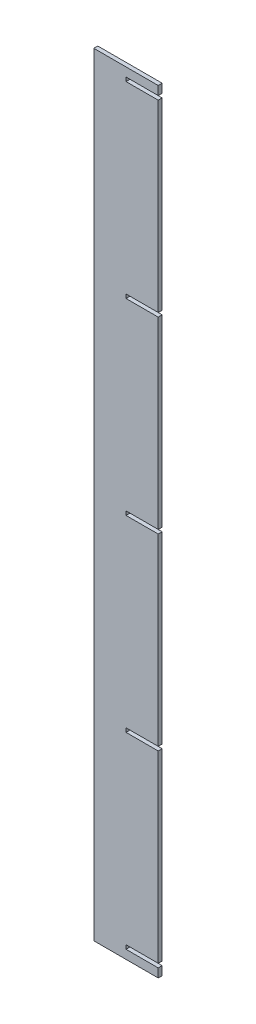
ISO-10303-21;
HEADER;
FILE_DESCRIPTION(('STEP AP214'),'2;1');
FILE_NAME('part.step','',(''),(''),'','','');
FILE_SCHEMA(('AUTOMOTIVE_DESIGN { 1 0 10303 214 1 1 1 1 }'));
ENDSEC;
DATA;
#1=APPLICATION_CONTEXT('core data for automotive mechanical design processes');
#2=APPLICATION_PROTOCOL_DEFINITION('international standard','automotive_design',2000,#1);
#3=PRODUCT_CONTEXT('',#1,'mechanical');
#4=PRODUCT('Part','Part','',(#3));
#5=PRODUCT_RELATED_PRODUCT_CATEGORY('part','',(#4));
#6=PRODUCT_DEFINITION_FORMATION('','',#4);
#7=PRODUCT_DEFINITION_CONTEXT('part definition',#1,'design');
#8=PRODUCT_DEFINITION('design','',#6,#7);
#9=PRODUCT_DEFINITION_SHAPE('','',#8);
#10=(LENGTH_UNIT() NAMED_UNIT(*) SI_UNIT(.MILLI.,.METRE.));
#11=(NAMED_UNIT(*) PLANE_ANGLE_UNIT() SI_UNIT($,.RADIAN.));
#12=(NAMED_UNIT(*) SI_UNIT($,.STERADIAN.) SOLID_ANGLE_UNIT());
#13=UNCERTAINTY_MEASURE_WITH_UNIT(LENGTH_MEASURE(1.E-05),#10,'distance_accuracy_value','');
#14=(GEOMETRIC_REPRESENTATION_CONTEXT(3) GLOBAL_UNCERTAINTY_ASSIGNED_CONTEXT((#13)) GLOBAL_UNIT_ASSIGNED_CONTEXT((#10,
#11,#12)) REPRESENTATION_CONTEXT('',''));
#15=CARTESIAN_POINT('',(0.,0.,0.));
#16=DIRECTION('',(0.,0.,1.));
#17=DIRECTION('',(1.,0.,0.));
#18=AXIS2_PLACEMENT_3D('',#15,#16,#17);
#19=CARTESIAN_POINT('',(25160.7465239422,0.,9.398));
#20=DIRECTION('',(1.,0.,0.));
#21=DIRECTION('',(0.,0.,-1.));
#22=AXIS2_PLACEMENT_3D('',#19,#20,#21);
#23=PLANE('',#22);
#24=DIRECTION('',(0.,-1.,0.));
#25=VECTOR('',#24,1.);
#26=CARTESIAN_POINT('',(25160.7465239422,0.,0.));
#27=LINE('',#26,#25);
#28=CARTESIAN_POINT('',(25160.7465239422,7030.05057188492,0.));
#29=VERTEX_POINT('',#28);
#30=CARTESIAN_POINT('',(25160.7465239422,7020.65257188492,0.));
#31=VERTEX_POINT('',#30);
#32=EDGE_CURVE('E284',#29,#31,#27,.T.);
#33=ORIENTED_EDGE('',*,*,#32,.F.);
#34=DIRECTION('',(0.,0.,-1.));
#35=VECTOR('',#34,1.);
#36=CARTESIAN_POINT('',(25160.7465239422,7030.05057188492,9.398));
#37=LINE('',#36,#35);
#38=CARTESIAN_POINT('',(25160.7465239422,7030.05057188492,9.398));
#39=VERTEX_POINT('',#38);
#40=EDGE_CURVE('E11',#39,#29,#37,.T.);
#41=ORIENTED_EDGE('',*,*,#40,.F.);
#42=DIRECTION('',(0.,-1.,0.));
#43=VECTOR('',#42,1.);
#44=CARTESIAN_POINT('',(25160.7465239422,0.,9.398));
#45=LINE('',#44,#43);
#46=CARTESIAN_POINT('',(25160.7465239422,7020.65257188492,9.398));
#47=VERTEX_POINT('',#46);
#48=EDGE_CURVE('E239',#39,#47,#45,.T.);
#49=ORIENTED_EDGE('',*,*,#48,.T.);
#50=DIRECTION('',(0.,0.,-1.));
#51=VECTOR('',#50,1.);
#52=CARTESIAN_POINT('',(25160.7465239422,7020.65257188492,9.398));
#53=LINE('',#52,#51);
#54=EDGE_CURVE('E51',#47,#31,#53,.T.);
#55=ORIENTED_EDGE('',*,*,#54,.T.);
#56=EDGE_LOOP('',(#33,#41,#49,#55));
#57=FACE_BOUND('',#56,.T.);
#58=ADVANCED_FACE('F35',(#57),#23,.T.);
#59=CARTESIAN_POINT('',(0.,7030.05057188492,9.398));
#60=DIRECTION('',(0.,-1.,0.));
#61=DIRECTION('',(0.,0.,-1.));
#62=AXIS2_PLACEMENT_3D('',#59,#60,#61);
#63=PLANE('',#62);
#64=DIRECTION('',(-1.,0.,0.));
#65=VECTOR('',#64,1.);
#66=CARTESIAN_POINT('',(0.,7030.05057188492,0.));
#67=LINE('',#66,#65);
#68=CARTESIAN_POINT('',(25236.9465239422,7030.05057188492,0.));
#69=VERTEX_POINT('',#68);
#70=EDGE_CURVE('E286',#69,#29,#67,.T.);
#71=ORIENTED_EDGE('',*,*,#70,.F.);
#72=DIRECTION('',(0.,0.,-1.));
#73=VECTOR('',#72,1.);
#74=CARTESIAN_POINT('',(25236.9465239422,7030.05057188492,9.398));
#75=LINE('',#74,#73);
#76=CARTESIAN_POINT('',(25236.9465239422,7030.05057188492,9.398));
#77=VERTEX_POINT('',#76);
#78=EDGE_CURVE('E43',#77,#69,#75,.T.);
#79=ORIENTED_EDGE('',*,*,#78,.F.);
#80=DIRECTION('',(-1.,0.,0.));
#81=VECTOR('',#80,1.);
#82=CARTESIAN_POINT('',(0.,7030.05057188492,9.398));
#83=LINE('',#82,#81);
#84=EDGE_CURVE('E230',#77,#39,#83,.T.);
#85=ORIENTED_EDGE('',*,*,#84,.T.);
#86=ORIENTED_EDGE('',*,*,#40,.T.);
#87=EDGE_LOOP('',(#71,#79,#85,#86));
#88=FACE_BOUND('',#87,.T.);
#89=ADVANCED_FACE('F389',(#88),#63,.T.);
#90=CARTESIAN_POINT('',(25236.9465239422,0.,9.398));
#91=DIRECTION('',(-1.,0.,0.));
#92=DIRECTION('',(0.,0.,1.));
#93=AXIS2_PLACEMENT_3D('',#90,#91,#92);
#94=PLANE('',#93);
#95=DIRECTION('',(0.,1.,0.));
#96=VECTOR('',#95,1.);
#97=CARTESIAN_POINT('',(25236.9465239422,0.,0.));
#98=LINE('',#97,#96);
#99=CARTESIAN_POINT('',(25236.9465239422,7465.15257188492,0.));
#100=VERTEX_POINT('',#99);
#101=EDGE_CURVE('E289',#69,#100,#98,.T.);
#102=ORIENTED_EDGE('',*,*,#101,.T.);
#103=DIRECTION('',(0.,0.,-1.));
#104=VECTOR('',#103,1.);
#105=CARTESIAN_POINT('',(25236.9465239422,7465.15257188492,9.398));
#106=LINE('',#105,#104);
#107=CARTESIAN_POINT('',(25236.9465239422,7465.15257188492,9.398));
#108=VERTEX_POINT('',#107);
#109=EDGE_CURVE('E380',#108,#100,#106,.T.);
#110=ORIENTED_EDGE('',*,*,#109,.F.);
#111=DIRECTION('',(0.,1.,0.));
#112=VECTOR('',#111,1.);
#113=CARTESIAN_POINT('',(25236.9465239422,0.,9.398));
#114=LINE('',#113,#112);
#115=EDGE_CURVE('E222',#77,#108,#114,.T.);
#116=ORIENTED_EDGE('',*,*,#115,.F.);
#117=ORIENTED_EDGE('',*,*,#78,.T.);
#118=EDGE_LOOP('',(#102,#110,#116,#117));
#119=FACE_BOUND('',#118,.T.);
#120=ADVANCED_FACE('F383',(#119),#94,.F.);
#121=CARTESIAN_POINT('',(0.,7465.15257188492,9.398));
#122=DIRECTION('',(0.,1.,0.));
#123=DIRECTION('',(0.,0.,1.));
#124=AXIS2_PLACEMENT_3D('',#121,#122,#123);
#125=PLANE('',#124);
#126=DIRECTION('',(1.,0.,0.));
#127=VECTOR('',#126,1.);
#128=CARTESIAN_POINT('',(0.,7465.15257188492,0.));
#129=LINE('',#128,#127);
#130=CARTESIAN_POINT('',(25160.7465239422,7465.15257188492,0.));
#131=VERTEX_POINT('',#130);
#132=EDGE_CURVE('E292',#131,#100,#129,.T.);
#133=ORIENTED_EDGE('',*,*,#132,.F.);
#134=DIRECTION('',(0.,0.,-1.));
#135=VECTOR('',#134,1.);
#136=CARTESIAN_POINT('',(25160.7465239422,7465.15257188492,9.398));
#137=LINE('',#136,#135);
#138=CARTESIAN_POINT('',(25160.7465239422,7465.15257188492,9.398));
#139=VERTEX_POINT('',#138);
#140=EDGE_CURVE('E378',#139,#131,#137,.T.);
#141=ORIENTED_EDGE('',*,*,#140,.F.);
#142=DIRECTION('',(1.,0.,0.));
#143=VECTOR('',#142,1.);
#144=CARTESIAN_POINT('',(0.,7465.15257188492,9.398));
#145=LINE('',#144,#143);
#146=EDGE_CURVE('E229',#139,#108,#145,.T.);
#147=ORIENTED_EDGE('',*,*,#146,.T.);
#148=ORIENTED_EDGE('',*,*,#109,.T.);
#149=EDGE_LOOP('',(#133,#141,#147,#148));
#150=FACE_BOUND('',#149,.T.);
#151=ADVANCED_FACE('F408',(#150),#125,.T.);
#152=CARTESIAN_POINT('',(25160.7465239422,0.,9.398));
#153=DIRECTION('',(1.,0.,0.));
#154=DIRECTION('',(0.,0.,-1.));
#155=AXIS2_PLACEMENT_3D('',#152,#153,#154);
#156=PLANE('',#155);
#157=DIRECTION('',(0.,-1.,0.));
#158=VECTOR('',#157,1.);
#159=CARTESIAN_POINT('',(25160.7465239422,0.,0.));
#160=LINE('',#159,#158);
#161=CARTESIAN_POINT('',(25160.7465239422,7474.55057188492,0.));
#162=VERTEX_POINT('',#161);
#163=EDGE_CURVE('E297',#162,#131,#160,.T.);
#164=ORIENTED_EDGE('',*,*,#163,.F.);
#165=DIRECTION('',(0.,0.,-1.));
#166=VECTOR('',#165,1.);
#167=CARTESIAN_POINT('',(25160.7465239422,7474.55057188492,9.398));
#168=LINE('',#167,#166);
#169=CARTESIAN_POINT('',(25160.7465239422,7474.55057188492,9.398));
#170=VERTEX_POINT('',#169);
#171=EDGE_CURVE('E376',#170,#162,#168,.T.);
#172=ORIENTED_EDGE('',*,*,#171,.F.);
#173=DIRECTION('',(0.,-1.,0.));
#174=VECTOR('',#173,1.);
#175=CARTESIAN_POINT('',(25160.7465239422,0.,9.398));
#176=LINE('',#175,#174);
#177=EDGE_CURVE('E237',#170,#139,#176,.T.);
#178=ORIENTED_EDGE('',*,*,#177,.T.);
#179=ORIENTED_EDGE('',*,*,#140,.T.);
#180=EDGE_LOOP('',(#164,#172,#178,#179));
#181=FACE_BOUND('',#180,.T.);
#182=ADVANCED_FACE('F413',(#181),#156,.T.);
#183=CARTESIAN_POINT('',(0.,7474.55057188492,9.398));
#184=DIRECTION('',(0.,-1.,0.));
#185=DIRECTION('',(0.,0.,-1.));
#186=AXIS2_PLACEMENT_3D('',#183,#184,#185);
#187=PLANE('',#186);
#188=DIRECTION('',(-1.,0.,0.));
#189=VECTOR('',#188,1.);
#190=CARTESIAN_POINT('',(0.,7474.55057188492,0.));
#191=LINE('',#190,#189);
#192=CARTESIAN_POINT('',(25236.9465239422,7474.55057188492,0.));
#193=VERTEX_POINT('',#192);
#194=EDGE_CURVE('E300',#193,#162,#191,.T.);
#195=ORIENTED_EDGE('',*,*,#194,.F.);
#196=DIRECTION('',(0.,0.,-1.));
#197=VECTOR('',#196,1.);
#198=CARTESIAN_POINT('',(25236.9465239422,7474.55057188492,9.398));
#199=LINE('',#198,#197);
#200=CARTESIAN_POINT('',(25236.9465239422,7474.55057188492,9.398));
#201=VERTEX_POINT('',#200);
#202=EDGE_CURVE('E374',#201,#193,#199,.T.);
#203=ORIENTED_EDGE('',*,*,#202,.F.);
#204=DIRECTION('',(-1.,0.,0.));
#205=VECTOR('',#204,1.);
#206=CARTESIAN_POINT('',(0.,7474.55057188492,9.398));
#207=LINE('',#206,#205);
#208=EDGE_CURVE('E241',#201,#170,#207,.T.);
#209=ORIENTED_EDGE('',*,*,#208,.T.);
#210=ORIENTED_EDGE('',*,*,#171,.T.);
#211=EDGE_LOOP('',(#195,#203,#209,#210));
#212=FACE_BOUND('',#211,.T.);
#213=ADVANCED_FACE('F417',(#212),#187,.T.);
#214=CARTESIAN_POINT('',(25236.9465239422,7909.65257188492,0.));
#215=VERTEX_POINT('',#214);
#216=EDGE_CURVE('E294',#193,#215,#98,.T.);
#217=ORIENTED_EDGE('',*,*,#216,.T.);
#218=DIRECTION('',(0.,0.,-1.));
#219=VECTOR('',#218,1.);
#220=CARTESIAN_POINT('',(25236.9465239422,7909.65257188492,9.398));
#221=LINE('',#220,#219);
#222=CARTESIAN_POINT('',(25236.9465239422,7909.65257188492,9.398));
#223=VERTEX_POINT('',#222);
#224=EDGE_CURVE('E372',#223,#215,#221,.T.);
#225=ORIENTED_EDGE('',*,*,#224,.F.);
#226=EDGE_CURVE('E231',#201,#223,#114,.T.);
#227=ORIENTED_EDGE('',*,*,#226,.F.);
#228=ORIENTED_EDGE('',*,*,#202,.T.);
#229=EDGE_LOOP('',(#217,#225,#227,#228));
#230=FACE_BOUND('',#229,.T.);
#231=ADVANCED_FACE('F409',(#230),#94,.F.);
#232=CARTESIAN_POINT('',(0.,7909.65257188492,9.398));
#233=DIRECTION('',(0.,1.,0.));
#234=DIRECTION('',(0.,0.,1.));
#235=AXIS2_PLACEMENT_3D('',#232,#233,#234);
#236=PLANE('',#235);
#237=DIRECTION('',(1.,0.,0.));
#238=VECTOR('',#237,1.);
#239=CARTESIAN_POINT('',(0.,7909.65257188492,0.));
#240=LINE('',#239,#238);
#241=CARTESIAN_POINT('',(25160.7465239422,7909.65257188492,0.));
#242=VERTEX_POINT('',#241);
#243=EDGE_CURVE('E303',#242,#215,#240,.T.);
#244=ORIENTED_EDGE('',*,*,#243,.F.);
#245=DIRECTION('',(0.,0.,-1.));
#246=VECTOR('',#245,1.);
#247=CARTESIAN_POINT('',(25160.7465239422,7909.65257188492,9.398));
#248=LINE('',#247,#246);
#249=CARTESIAN_POINT('',(25160.7465239422,7909.65257188492,9.398));
#250=VERTEX_POINT('',#249);
#251=EDGE_CURVE('E370',#250,#242,#248,.T.);
#252=ORIENTED_EDGE('',*,*,#251,.F.);
#253=DIRECTION('',(1.,0.,0.));
#254=VECTOR('',#253,1.);
#255=CARTESIAN_POINT('',(0.,7909.65257188492,9.398));
#256=LINE('',#255,#254);
#257=EDGE_CURVE('E240',#250,#223,#256,.T.);
#258=ORIENTED_EDGE('',*,*,#257,.T.);
#259=ORIENTED_EDGE('',*,*,#224,.T.);
#260=EDGE_LOOP('',(#244,#252,#258,#259));
#261=FACE_BOUND('',#260,.T.);
#262=ADVANCED_FACE('F422',(#261),#236,.T.);
#263=CARTESIAN_POINT('',(25160.7465239422,0.,9.398));
#264=DIRECTION('',(1.,0.,0.));
#265=DIRECTION('',(0.,0.,-1.));
#266=AXIS2_PLACEMENT_3D('',#263,#264,#265);
#267=PLANE('',#266);
#268=DIRECTION('',(0.,-1.,0.));
#269=VECTOR('',#268,1.);
#270=CARTESIAN_POINT('',(25160.7465239422,0.,0.));
#271=LINE('',#270,#269);
#272=CARTESIAN_POINT('',(25160.7465239422,7919.05057188492,0.));
#273=VERTEX_POINT('',#272);
#274=EDGE_CURVE('E306',#273,#242,#271,.T.);
#275=ORIENTED_EDGE('',*,*,#274,.F.);
#276=DIRECTION('',(0.,0.,-1.));
#277=VECTOR('',#276,1.);
#278=CARTESIAN_POINT('',(25160.7465239422,7919.05057188492,9.398));
#279=LINE('',#278,#277);
#280=CARTESIAN_POINT('',(25160.7465239422,7919.05057188492,9.398));
#281=VERTEX_POINT('',#280);
#282=EDGE_CURVE('E368',#281,#273,#279,.T.);
#283=ORIENTED_EDGE('',*,*,#282,.F.);
#284=DIRECTION('',(0.,-1.,0.));
#285=VECTOR('',#284,1.);
#286=CARTESIAN_POINT('',(25160.7465239422,0.,9.398));
#287=LINE('',#286,#285);
#288=EDGE_CURVE('E248',#281,#250,#287,.T.);
#289=ORIENTED_EDGE('',*,*,#288,.T.);
#290=ORIENTED_EDGE('',*,*,#251,.T.);
#291=EDGE_LOOP('',(#275,#283,#289,#290));
#292=FACE_BOUND('',#291,.T.);
#293=ADVANCED_FACE('F425',(#292),#267,.T.);
#294=CARTESIAN_POINT('',(0.,7919.05057188492,9.398));
#295=DIRECTION('',(0.,-1.,0.));
#296=DIRECTION('',(0.,0.,-1.));
#297=AXIS2_PLACEMENT_3D('',#294,#295,#296);
#298=PLANE('',#297);
#299=DIRECTION('',(-1.,0.,0.));
#300=VECTOR('',#299,1.);
#301=CARTESIAN_POINT('',(0.,7919.05057188492,0.));
#302=LINE('',#301,#300);
#303=CARTESIAN_POINT('',(25236.9465239422,7919.05057188492,0.));
#304=VERTEX_POINT('',#303);
#305=EDGE_CURVE('E309',#304,#273,#302,.T.);
#306=ORIENTED_EDGE('',*,*,#305,.F.);
#307=DIRECTION('',(0.,0.,-1.));
#308=VECTOR('',#307,1.);
#309=CARTESIAN_POINT('',(25236.9465239422,7919.05057188492,9.398));
#310=LINE('',#309,#308);
#311=CARTESIAN_POINT('',(25236.9465239422,7919.05057188492,9.398));
#312=VERTEX_POINT('',#311);
#313=EDGE_CURVE('E366',#312,#304,#310,.T.);
#314=ORIENTED_EDGE('',*,*,#313,.F.);
#315=DIRECTION('',(-1.,0.,0.));
#316=VECTOR('',#315,1.);
#317=CARTESIAN_POINT('',(0.,7919.05057188492,9.398));
#318=LINE('',#317,#316);
#319=EDGE_CURVE('E253',#312,#281,#318,.T.);
#320=ORIENTED_EDGE('',*,*,#319,.T.);
#321=ORIENTED_EDGE('',*,*,#282,.T.);
#322=EDGE_LOOP('',(#306,#314,#320,#321));
#323=FACE_BOUND('',#322,.T.);
#324=ADVANCED_FACE('F429',(#323),#298,.T.);
#325=CARTESIAN_POINT('',(25236.9465239422,8354.15257188492,0.));
#326=VERTEX_POINT('',#325);
#327=EDGE_CURVE('E312',#304,#326,#98,.T.);
#328=ORIENTED_EDGE('',*,*,#327,.T.);
#329=DIRECTION('',(0.,0.,-1.));
#330=VECTOR('',#329,1.);
#331=CARTESIAN_POINT('',(25236.9465239422,8354.15257188492,9.398));
#332=LINE('',#331,#330);
#333=CARTESIAN_POINT('',(25236.9465239422,8354.15257188492,9.398));
#334=VERTEX_POINT('',#333);
#335=EDGE_CURVE('E364',#334,#326,#332,.T.);
#336=ORIENTED_EDGE('',*,*,#335,.F.);
#337=EDGE_CURVE('E242',#312,#334,#114,.T.);
#338=ORIENTED_EDGE('',*,*,#337,.F.);
#339=ORIENTED_EDGE('',*,*,#313,.T.);
#340=EDGE_LOOP('',(#328,#336,#338,#339));
#341=FACE_BOUND('',#340,.T.);
#342=ADVANCED_FACE('F433',(#341),#94,.F.);
#343=CARTESIAN_POINT('',(0.,8354.15257188492,9.398));
#344=DIRECTION('',(0.,1.,0.));
#345=DIRECTION('',(0.,0.,1.));
#346=AXIS2_PLACEMENT_3D('',#343,#344,#345);
#347=PLANE('',#346);
#348=DIRECTION('',(1.,0.,0.));
#349=VECTOR('',#348,1.);
#350=CARTESIAN_POINT('',(0.,8354.15257188492,0.));
#351=LINE('',#350,#349);
#352=CARTESIAN_POINT('',(25160.7465239422,8354.15257188492,0.));
#353=VERTEX_POINT('',#352);
#354=EDGE_CURVE('E313',#353,#326,#351,.T.);
#355=ORIENTED_EDGE('',*,*,#354,.F.);
#356=DIRECTION('',(0.,0.,-1.));
#357=VECTOR('',#356,1.);
#358=CARTESIAN_POINT('',(25160.7465239422,8354.15257188492,9.398));
#359=LINE('',#358,#357);
#360=CARTESIAN_POINT('',(25160.7465239422,8354.15257188492,9.398));
#361=VERTEX_POINT('',#360);
#362=EDGE_CURVE('E362',#361,#353,#359,.T.);
#363=ORIENTED_EDGE('',*,*,#362,.F.);
#364=DIRECTION('',(1.,0.,0.));
#365=VECTOR('',#364,1.);
#366=CARTESIAN_POINT('',(0.,8354.15257188492,9.398));
#367=LINE('',#366,#365);
#368=EDGE_CURVE('E252',#361,#334,#367,.T.);
#369=ORIENTED_EDGE('',*,*,#368,.T.);
#370=ORIENTED_EDGE('',*,*,#335,.T.);
#371=EDGE_LOOP('',(#355,#363,#369,#370));
#372=FACE_BOUND('',#371,.T.);
#373=ADVANCED_FACE('F435',(#372),#347,.T.);
#374=CARTESIAN_POINT('',(25160.7465239422,0.,9.398));
#375=DIRECTION('',(1.,0.,0.));
#376=DIRECTION('',(0.,0.,-1.));
#377=AXIS2_PLACEMENT_3D('',#374,#375,#376);
#378=PLANE('',#377);
#379=DIRECTION('',(0.,-1.,0.));
#380=VECTOR('',#379,1.);
#381=CARTESIAN_POINT('',(25160.7465239422,0.,0.));
#382=LINE('',#381,#380);
#383=CARTESIAN_POINT('',(25160.7465239422,8363.55057188492,0.));
#384=VERTEX_POINT('',#383);
#385=EDGE_CURVE('E316',#384,#353,#382,.T.);
#386=ORIENTED_EDGE('',*,*,#385,.F.);
#387=DIRECTION('',(0.,0.,-1.));
#388=VECTOR('',#387,1.);
#389=CARTESIAN_POINT('',(25160.7465239422,8363.55057188492,9.398));
#390=LINE('',#389,#388);
#391=CARTESIAN_POINT('',(25160.7465239422,8363.55057188492,9.398));
#392=VERTEX_POINT('',#391);
#393=EDGE_CURVE('E360',#392,#384,#390,.T.);
#394=ORIENTED_EDGE('',*,*,#393,.F.);
#395=DIRECTION('',(0.,-1.,0.));
#396=VECTOR('',#395,1.);
#397=CARTESIAN_POINT('',(25160.7465239422,0.,9.398));
#398=LINE('',#397,#396);
#399=EDGE_CURVE('E259',#392,#361,#398,.T.);
#400=ORIENTED_EDGE('',*,*,#399,.T.);
#401=ORIENTED_EDGE('',*,*,#362,.T.);
#402=EDGE_LOOP('',(#386,#394,#400,#401));
#403=FACE_BOUND('',#402,.T.);
#404=ADVANCED_FACE('F438',(#403),#378,.T.);
#405=CARTESIAN_POINT('',(0.,8363.55057188492,9.398));
#406=DIRECTION('',(0.,-1.,0.));
#407=DIRECTION('',(0.,0.,-1.));
#408=AXIS2_PLACEMENT_3D('',#405,#406,#407);
#409=PLANE('',#408);
#410=DIRECTION('',(-1.,0.,0.));
#411=VECTOR('',#410,1.);
#412=CARTESIAN_POINT('',(0.,8363.55057188492,0.));
#413=LINE('',#412,#411);
#414=CARTESIAN_POINT('',(25236.9465239422,8363.55057188492,0.));
#415=VERTEX_POINT('',#414);
#416=EDGE_CURVE('E319',#415,#384,#413,.T.);
#417=ORIENTED_EDGE('',*,*,#416,.F.);
#418=DIRECTION('',(0.,0.,-1.));
#419=VECTOR('',#418,1.);
#420=CARTESIAN_POINT('',(25236.9465239422,8363.55057188492,9.398));
#421=LINE('',#420,#419);
#422=CARTESIAN_POINT('',(25236.9465239422,8363.55057188492,9.398));
#423=VERTEX_POINT('',#422);
#424=EDGE_CURVE('E358',#423,#415,#421,.T.);
#425=ORIENTED_EDGE('',*,*,#424,.F.);
#426=DIRECTION('',(-1.,0.,0.));
#427=VECTOR('',#426,1.);
#428=CARTESIAN_POINT('',(0.,8363.55057188492,9.398));
#429=LINE('',#428,#427);
#430=EDGE_CURVE('E264',#423,#392,#429,.T.);
#431=ORIENTED_EDGE('',*,*,#430,.T.);
#432=ORIENTED_EDGE('',*,*,#393,.T.);
#433=EDGE_LOOP('',(#417,#425,#431,#432));
#434=FACE_BOUND('',#433,.T.);
#435=ADVANCED_FACE('F442',(#434),#409,.T.);
#436=CARTESIAN_POINT('',(25236.9465239422,8798.65257188492,0.));
#437=VERTEX_POINT('',#436);
#438=EDGE_CURVE('E322',#415,#437,#98,.T.);
#439=ORIENTED_EDGE('',*,*,#438,.T.);
#440=DIRECTION('',(0.,0.,-1.));
#441=VECTOR('',#440,1.);
#442=CARTESIAN_POINT('',(25236.9465239422,8798.65257188492,9.398));
#443=LINE('',#442,#441);
#444=CARTESIAN_POINT('',(25236.9465239422,8798.65257188492,9.398));
#445=VERTEX_POINT('',#444);
#446=EDGE_CURVE('E356',#445,#437,#443,.T.);
#447=ORIENTED_EDGE('',*,*,#446,.F.);
#448=EDGE_CURVE('E228',#423,#445,#114,.T.);
#449=ORIENTED_EDGE('',*,*,#448,.F.);
#450=ORIENTED_EDGE('',*,*,#424,.T.);
#451=EDGE_LOOP('',(#439,#447,#449,#450));
#452=FACE_BOUND('',#451,.T.);
#453=ADVANCED_FACE('F446',(#452),#94,.F.);
#454=CARTESIAN_POINT('',(0.,8798.65257188492,9.398));
#455=DIRECTION('',(0.,1.,0.));
#456=DIRECTION('',(0.,0.,1.));
#457=AXIS2_PLACEMENT_3D('',#454,#455,#456);
#458=PLANE('',#457);
#459=DIRECTION('',(1.,0.,0.));
#460=VECTOR('',#459,1.);
#461=CARTESIAN_POINT('',(0.,8798.65257188492,0.));
#462=LINE('',#461,#460);
#463=CARTESIAN_POINT('',(25160.7465239422,8798.65257188492,0.));
#464=VERTEX_POINT('',#463);
#465=EDGE_CURVE('E323',#464,#437,#462,.T.);
#466=ORIENTED_EDGE('',*,*,#465,.F.);
#467=DIRECTION('',(0.,0.,-1.));
#468=VECTOR('',#467,1.);
#469=CARTESIAN_POINT('',(25160.7465239422,8798.65257188492,9.398));
#470=LINE('',#469,#468);
#471=CARTESIAN_POINT('',(25160.7465239422,8798.65257188492,9.398));
#472=VERTEX_POINT('',#471);
#473=EDGE_CURVE('E354',#472,#464,#470,.T.);
#474=ORIENTED_EDGE('',*,*,#473,.F.);
#475=DIRECTION('',(1.,0.,0.));
#476=VECTOR('',#475,1.);
#477=CARTESIAN_POINT('',(0.,8798.65257188492,9.398));
#478=LINE('',#477,#476);
#479=EDGE_CURVE('E263',#472,#445,#478,.T.);
#480=ORIENTED_EDGE('',*,*,#479,.T.);
#481=ORIENTED_EDGE('',*,*,#446,.T.);
#482=EDGE_LOOP('',(#466,#474,#480,#481));
#483=FACE_BOUND('',#482,.T.);
#484=ADVANCED_FACE('F447',(#483),#458,.T.);
#485=CARTESIAN_POINT('',(25160.7465239422,0.,9.398));
#486=DIRECTION('',(1.,0.,0.));
#487=DIRECTION('',(0.,0.,-1.));
#488=AXIS2_PLACEMENT_3D('',#485,#486,#487);
#489=PLANE('',#488);
#490=DIRECTION('',(0.,-1.,0.));
#491=VECTOR('',#490,1.);
#492=CARTESIAN_POINT('',(25160.7465239422,0.,0.));
#493=LINE('',#492,#491);
#494=CARTESIAN_POINT('',(25160.7465239422,8808.05057188492,0.));
#495=VERTEX_POINT('',#494);
#496=EDGE_CURVE('E326',#495,#464,#493,.T.);
#497=ORIENTED_EDGE('',*,*,#496,.F.);
#498=DIRECTION('',(0.,0.,-1.));
#499=VECTOR('',#498,1.);
#500=CARTESIAN_POINT('',(25160.7465239422,8808.05057188492,9.398));
#501=LINE('',#500,#499);
#502=CARTESIAN_POINT('',(25160.7465239422,8808.05057188492,9.398));
#503=VERTEX_POINT('',#502);
#504=EDGE_CURVE('E352',#503,#495,#501,.T.);
#505=ORIENTED_EDGE('',*,*,#504,.F.);
#506=DIRECTION('',(0.,-1.,0.));
#507=VECTOR('',#506,1.);
#508=CARTESIAN_POINT('',(25160.7465239422,0.,9.398));
#509=LINE('',#508,#507);
#510=EDGE_CURVE('E270',#503,#472,#509,.T.);
#511=ORIENTED_EDGE('',*,*,#510,.T.);
#512=ORIENTED_EDGE('',*,*,#473,.T.);
#513=EDGE_LOOP('',(#497,#505,#511,#512));
#514=FACE_BOUND('',#513,.T.);
#515=ADVANCED_FACE('F450',(#514),#489,.T.);
#516=CARTESIAN_POINT('',(0.,8808.05057188492,9.398));
#517=DIRECTION('',(0.,-1.,0.));
#518=DIRECTION('',(0.,0.,-1.));
#519=AXIS2_PLACEMENT_3D('',#516,#517,#518);
#520=PLANE('',#519);
#521=DIRECTION('',(-1.,0.,0.));
#522=VECTOR('',#521,1.);
#523=CARTESIAN_POINT('',(0.,8808.05057188492,0.));
#524=LINE('',#523,#522);
#525=CARTESIAN_POINT('',(25236.9465239422,8808.05057188492,0.));
#526=VERTEX_POINT('',#525);
#527=EDGE_CURVE('E329',#526,#495,#524,.T.);
#528=ORIENTED_EDGE('',*,*,#527,.F.);
#529=DIRECTION('',(0.,0.,-1.));
#530=VECTOR('',#529,1.);
#531=CARTESIAN_POINT('',(25236.9465239422,8808.05057188492,9.398));
#532=LINE('',#531,#530);
#533=CARTESIAN_POINT('',(25236.9465239422,8808.05057188492,9.398));
#534=VERTEX_POINT('',#533);
#535=EDGE_CURVE('E350',#534,#526,#532,.T.);
#536=ORIENTED_EDGE('',*,*,#535,.F.);
#537=DIRECTION('',(-1.,0.,0.));
#538=VECTOR('',#537,1.);
#539=CARTESIAN_POINT('',(0.,8808.05057188492,9.398));
#540=LINE('',#539,#538);
#541=EDGE_CURVE('E227',#534,#503,#540,.T.);
#542=ORIENTED_EDGE('',*,*,#541,.T.);
#543=ORIENTED_EDGE('',*,*,#504,.T.);
#544=EDGE_LOOP('',(#528,#536,#542,#543));
#545=FACE_BOUND('',#544,.T.);
#546=ADVANCED_FACE('F454',(#545),#520,.T.);
#547=CARTESIAN_POINT('',(25236.9465239422,8828.75157188492,0.));
#548=VERTEX_POINT('',#547);
#549=EDGE_CURVE('E332',#526,#548,#98,.T.);
#550=ORIENTED_EDGE('',*,*,#549,.T.);
#551=DIRECTION('',(0.,0.,-1.));
#552=VECTOR('',#551,1.);
#553=CARTESIAN_POINT('',(25236.9465239422,8828.75157188492,9.398));
#554=LINE('',#553,#552);
#555=CARTESIAN_POINT('',(25236.9465239422,8828.75157188492,9.398));
#556=VERTEX_POINT('',#555);
#557=EDGE_CURVE('E347',#556,#548,#554,.T.);
#558=ORIENTED_EDGE('',*,*,#557,.F.);
#559=EDGE_CURVE('E221',#534,#556,#114,.T.);
#560=ORIENTED_EDGE('',*,*,#559,.F.);
#561=ORIENTED_EDGE('',*,*,#535,.T.);
#562=EDGE_LOOP('',(#550,#558,#560,#561));
#563=FACE_BOUND('',#562,.T.);
#564=ADVANCED_FACE('F399',(#563),#94,.F.);
#565=CARTESIAN_POINT('',(0.,8828.75157188492,9.398));
#566=DIRECTION('',(0.,-1.,0.));
#567=DIRECTION('',(0.,0.,-1.));
#568=AXIS2_PLACEMENT_3D('',#565,#566,#567);
#569=PLANE('',#568);
#570=DIRECTION('',(-1.,0.,0.));
#571=VECTOR('',#570,1.);
#572=CARTESIAN_POINT('',(0.,8828.75157188492,0.));
#573=LINE('',#572,#571);
#574=CARTESIAN_POINT('',(25084.5465239422,8828.75157188492,0.));
#575=VERTEX_POINT('',#574);
#576=EDGE_CURVE('E333',#548,#575,#573,.T.);
#577=ORIENTED_EDGE('',*,*,#576,.T.);
#578=DIRECTION('',(0.,0.,-1.));
#579=VECTOR('',#578,1.);
#580=CARTESIAN_POINT('',(25084.5465239422,8828.75157188492,9.398));
#581=LINE('',#580,#579);
#582=CARTESIAN_POINT('',(25084.5465239422,8828.75157188492,9.398));
#583=VERTEX_POINT('',#582);
#584=EDGE_CURVE('E344',#583,#575,#581,.T.);
#585=ORIENTED_EDGE('',*,*,#584,.F.);
#586=DIRECTION('',(-1.,0.,0.));
#587=VECTOR('',#586,1.);
#588=CARTESIAN_POINT('',(0.,8828.75157188492,9.398));
#589=LINE('',#588,#587);
#590=EDGE_CURVE('E226',#556,#583,#589,.T.);
#591=ORIENTED_EDGE('',*,*,#590,.F.);
#592=ORIENTED_EDGE('',*,*,#557,.T.);
#593=EDGE_LOOP('',(#577,#585,#591,#592));
#594=FACE_BOUND('',#593,.T.);
#595=ADVANCED_FACE('F459',(#594),#569,.F.);
#596=CARTESIAN_POINT('',(25084.5465239422,0.,9.398));
#597=DIRECTION('',(1.,0.,0.));
#598=DIRECTION('',(0.,0.,-1.));
#599=AXIS2_PLACEMENT_3D('',#596,#597,#598);
#600=PLANE('',#599);
#601=DIRECTION('',(0.,-1.,0.));
#602=VECTOR('',#601,1.);
#603=CARTESIAN_POINT('',(25084.5465239422,0.,0.));
#604=LINE('',#603,#602);
#605=CARTESIAN_POINT('',(25084.5465239422,6999.95157188492,0.));
#606=VERTEX_POINT('',#605);
#607=EDGE_CURVE('E335',#575,#606,#604,.T.);
#608=ORIENTED_EDGE('',*,*,#607,.T.);
#609=DIRECTION('',(0.,0.,-1.));
#610=VECTOR('',#609,1.);
#611=CARTESIAN_POINT('',(25084.5465239422,6999.95157188492,9.398));
#612=LINE('',#611,#610);
#613=CARTESIAN_POINT('',(25084.5465239422,6999.95157188492,9.398));
#614=VERTEX_POINT('',#613);
#615=EDGE_CURVE('E216',#614,#606,#612,.T.);
#616=ORIENTED_EDGE('',*,*,#615,.F.);
#617=DIRECTION('',(0.,-1.,0.));
#618=VECTOR('',#617,1.);
#619=CARTESIAN_POINT('',(25084.5465239422,0.,9.398));
#620=LINE('',#619,#618);
#621=EDGE_CURVE('E204',#583,#614,#620,.T.);
#622=ORIENTED_EDGE('',*,*,#621,.F.);
#623=ORIENTED_EDGE('',*,*,#584,.T.);
#624=EDGE_LOOP('',(#608,#616,#622,#623));
#625=FACE_BOUND('',#624,.T.);
#626=ADVANCED_FACE('F462',(#625),#600,.F.);
#627=CARTESIAN_POINT('',(0.,6999.95157188492,9.398));
#628=DIRECTION('',(0.,1.,0.));
#629=DIRECTION('',(0.,0.,1.));
#630=AXIS2_PLACEMENT_3D('',#627,#628,#629);
#631=PLANE('',#630);
#632=DIRECTION('',(1.,0.,0.));
#633=VECTOR('',#632,1.);
#634=CARTESIAN_POINT('',(0.,6999.95157188492,0.));
#635=LINE('',#634,#633);
#636=CARTESIAN_POINT('',(25236.9465239422,6999.95157188492,0.));
#637=VERTEX_POINT('',#636);
#638=EDGE_CURVE('E213',#606,#637,#635,.T.);
#639=ORIENTED_EDGE('',*,*,#638,.T.);
#640=DIRECTION('',(0.,0.,-1.));
#641=VECTOR('',#640,1.);
#642=CARTESIAN_POINT('',(25236.9465239422,6999.95157188492,9.398));
#643=LINE('',#642,#641);
#644=CARTESIAN_POINT('',(25236.9465239422,6999.95157188492,9.398));
#645=VERTEX_POINT('',#644);
#646=EDGE_CURVE('E210',#645,#637,#643,.T.);
#647=ORIENTED_EDGE('',*,*,#646,.F.);
#648=DIRECTION('',(1.,0.,0.));
#649=VECTOR('',#648,1.);
#650=CARTESIAN_POINT('',(0.,6999.95157188492,9.398));
#651=LINE('',#650,#649);
#652=EDGE_CURVE('E197',#614,#645,#651,.T.);
#653=ORIENTED_EDGE('',*,*,#652,.F.);
#654=ORIENTED_EDGE('',*,*,#615,.T.);
#655=EDGE_LOOP('',(#639,#647,#653,#654));
#656=FACE_BOUND('',#655,.T.);
#657=ADVANCED_FACE('F211',(#656),#631,.F.);
#658=CARTESIAN_POINT('',(25236.9465239422,7020.65257188492,0.));
#659=VERTEX_POINT('',#658);
#660=EDGE_CURVE('E293',#637,#659,#98,.T.);
#661=ORIENTED_EDGE('',*,*,#660,.T.);
#662=DIRECTION('',(0.,0.,-1.));
#663=VECTOR('',#662,1.);
#664=CARTESIAN_POINT('',(25236.9465239422,7020.65257188492,9.398));
#665=LINE('',#664,#663);
#666=CARTESIAN_POINT('',(25236.9465239422,7020.65257188492,9.398));
#667=VERTEX_POINT('',#666);
#668=EDGE_CURVE('E125',#667,#659,#665,.T.);
#669=ORIENTED_EDGE('',*,*,#668,.F.);
#670=EDGE_CURVE('E202',#645,#667,#114,.T.);
#671=ORIENTED_EDGE('',*,*,#670,.F.);
#672=ORIENTED_EDGE('',*,*,#646,.T.);
#673=EDGE_LOOP('',(#661,#669,#671,#672));
#674=FACE_BOUND('',#673,.T.);
#675=ADVANCED_FACE('F218',(#674),#94,.F.);
#676=CARTESIAN_POINT('',(0.,7020.65257188492,9.398));
#677=DIRECTION('',(0.,1.,0.));
#678=DIRECTION('',(0.,0.,1.));
#679=AXIS2_PLACEMENT_3D('',#676,#677,#678);
#680=PLANE('',#679);
#681=DIRECTION('',(1.,0.,0.));
#682=VECTOR('',#681,1.);
#683=CARTESIAN_POINT('',(0.,7020.65257188492,0.));
#684=LINE('',#683,#682);
#685=EDGE_CURVE('E338',#31,#659,#684,.T.);
#686=ORIENTED_EDGE('',*,*,#685,.F.);
#687=ORIENTED_EDGE('',*,*,#54,.F.);
#688=DIRECTION('',(1.,0.,0.));
#689=VECTOR('',#688,1.);
#690=CARTESIAN_POINT('',(0.,7020.65257188492,9.398));
#691=LINE('',#690,#689);
#692=EDGE_CURVE('E219',#47,#667,#691,.T.);
#693=ORIENTED_EDGE('',*,*,#692,.T.);
#694=ORIENTED_EDGE('',*,*,#668,.T.);
#695=EDGE_LOOP('',(#686,#687,#693,#694));
#696=FACE_BOUND('',#695,.T.);
#697=ADVANCED_FACE('F390',(#696),#680,.T.);
#698=CARTESIAN_POINT('',(0.,0.,9.398));
#699=DIRECTION('',(0.,0.,1.));
#700=DIRECTION('',(1.,0.,0.));
#701=AXIS2_PLACEMENT_3D('',#698,#699,#700);
#702=PLANE('',#701);
#703=ORIENTED_EDGE('',*,*,#48,.F.);
#704=ORIENTED_EDGE('',*,*,#84,.F.);
#705=ORIENTED_EDGE('',*,*,#115,.T.);
#706=ORIENTED_EDGE('',*,*,#146,.F.);
#707=ORIENTED_EDGE('',*,*,#177,.F.);
#708=ORIENTED_EDGE('',*,*,#208,.F.);
#709=ORIENTED_EDGE('',*,*,#226,.T.);
#710=ORIENTED_EDGE('',*,*,#257,.F.);
#711=ORIENTED_EDGE('',*,*,#288,.F.);
#712=ORIENTED_EDGE('',*,*,#319,.F.);
#713=ORIENTED_EDGE('',*,*,#337,.T.);
#714=ORIENTED_EDGE('',*,*,#368,.F.);
#715=ORIENTED_EDGE('',*,*,#399,.F.);
#716=ORIENTED_EDGE('',*,*,#430,.F.);
#717=ORIENTED_EDGE('',*,*,#448,.T.);
#718=ORIENTED_EDGE('',*,*,#479,.F.);
#719=ORIENTED_EDGE('',*,*,#510,.F.);
#720=ORIENTED_EDGE('',*,*,#541,.F.);
#721=ORIENTED_EDGE('',*,*,#559,.T.);
#722=ORIENTED_EDGE('',*,*,#590,.T.);
#723=ORIENTED_EDGE('',*,*,#621,.T.);
#724=ORIENTED_EDGE('',*,*,#652,.T.);
#725=ORIENTED_EDGE('',*,*,#670,.T.);
#726=ORIENTED_EDGE('',*,*,#692,.F.);
#727=EDGE_LOOP('',(#703,#704,#705,#706,#707,#708,#709,#710,#711,#712,#713,#714,#715,#716,#717,
#718,#719,#720,#721,#722,#723,#724,#725,#726));
#728=FACE_BOUND('',#727,.T.);
#729=ADVANCED_FACE('F199',(#728),#702,.T.);
#730=CARTESIAN_POINT('',(0.,0.,0.));
#731=DIRECTION('',(0.,0.,1.));
#732=DIRECTION('',(1.,0.,0.));
#733=AXIS2_PLACEMENT_3D('',#730,#731,#732);
#734=PLANE('',#733);
#735=ORIENTED_EDGE('',*,*,#32,.T.);
#736=ORIENTED_EDGE('',*,*,#685,.T.);
#737=ORIENTED_EDGE('',*,*,#660,.F.);
#738=ORIENTED_EDGE('',*,*,#638,.F.);
#739=ORIENTED_EDGE('',*,*,#607,.F.);
#740=ORIENTED_EDGE('',*,*,#576,.F.);
#741=ORIENTED_EDGE('',*,*,#549,.F.);
#742=ORIENTED_EDGE('',*,*,#527,.T.);
#743=ORIENTED_EDGE('',*,*,#496,.T.);
#744=ORIENTED_EDGE('',*,*,#465,.T.);
#745=ORIENTED_EDGE('',*,*,#438,.F.);
#746=ORIENTED_EDGE('',*,*,#416,.T.);
#747=ORIENTED_EDGE('',*,*,#385,.T.);
#748=ORIENTED_EDGE('',*,*,#354,.T.);
#749=ORIENTED_EDGE('',*,*,#327,.F.);
#750=ORIENTED_EDGE('',*,*,#305,.T.);
#751=ORIENTED_EDGE('',*,*,#274,.T.);
#752=ORIENTED_EDGE('',*,*,#243,.T.);
#753=ORIENTED_EDGE('',*,*,#216,.F.);
#754=ORIENTED_EDGE('',*,*,#194,.T.);
#755=ORIENTED_EDGE('',*,*,#163,.T.);
#756=ORIENTED_EDGE('',*,*,#132,.T.);
#757=ORIENTED_EDGE('',*,*,#101,.F.);
#758=ORIENTED_EDGE('',*,*,#70,.T.);
#759=EDGE_LOOP('',(#735,#736,#737,#738,#739,#740,#741,#742,#743,#744,#745,#746,#747,#748,#749,
#750,#751,#752,#753,#754,#755,#756,#757,#758));
#760=FACE_BOUND('',#759,.T.);
#761=ADVANCED_FACE('F387',(#760),#734,.F.);
#762=CLOSED_SHELL('',(#58,#89,#120,#151,#182,#213,#231,#262,#293,#324,#342,#373,#404,#435,#453,
#484,#515,#546,#564,#595,#626,#657,#675,#697,#729,#761));
#763=MANIFOLD_SOLID_BREP('B2',#762);
#764=ADVANCED_BREP_SHAPE_REPRESENTATION('',(#18,#763),#14);
#765=SHAPE_DEFINITION_REPRESENTATION(#9,#764);
ENDSEC;
END-ISO-10303-21;
